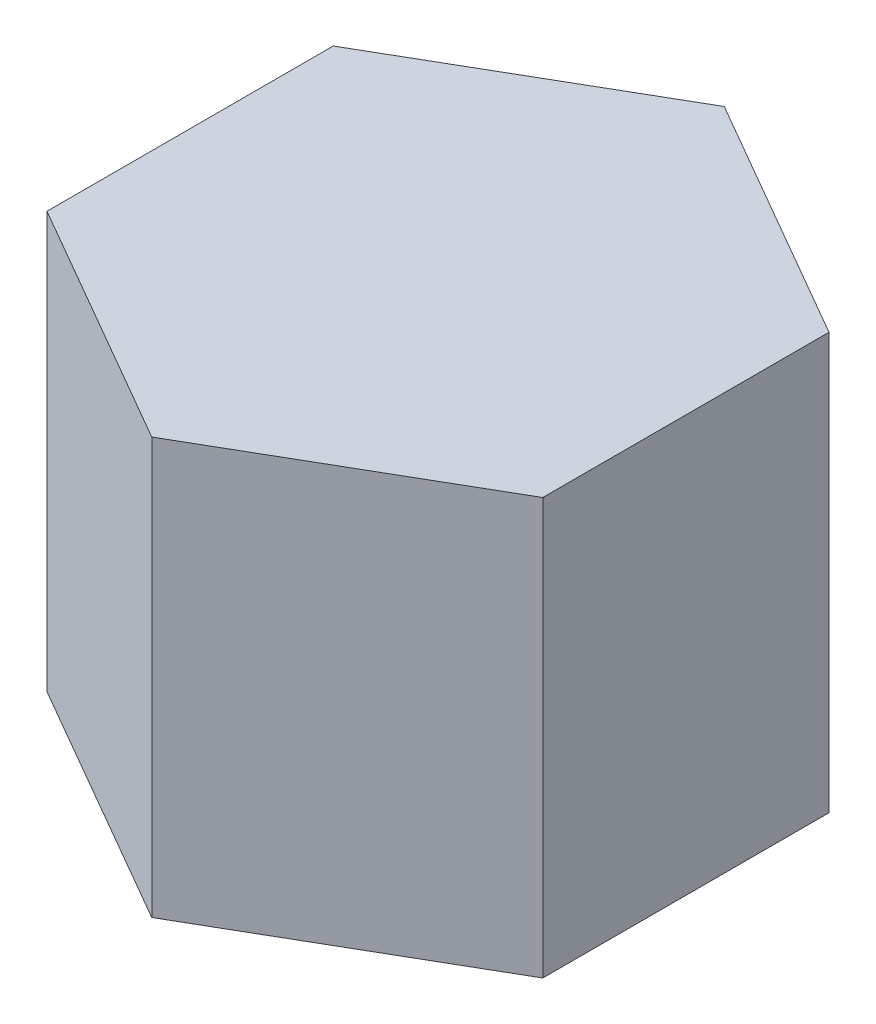
ISO-10303-21;
HEADER;
FILE_DESCRIPTION(('STEP AP214'),'2;1');
FILE_NAME('part.step','',(''),(''),'','','');
FILE_SCHEMA(('AUTOMOTIVE_DESIGN { 1 0 10303 214 1 1 1 1 }'));
ENDSEC;
DATA;
#1=APPLICATION_CONTEXT('core data for automotive mechanical design processes');
#2=APPLICATION_PROTOCOL_DEFINITION('international standard','automotive_design',2000,#1);
#3=PRODUCT_CONTEXT('',#1,'mechanical');
#4=PRODUCT('Part','Part','',(#3));
#5=PRODUCT_RELATED_PRODUCT_CATEGORY('part','',(#4));
#6=PRODUCT_DEFINITION_FORMATION('','',#4);
#7=PRODUCT_DEFINITION_CONTEXT('part definition',#1,'design');
#8=PRODUCT_DEFINITION('design','',#6,#7);
#9=PRODUCT_DEFINITION_SHAPE('','',#8);
#10=(LENGTH_UNIT() NAMED_UNIT(*) SI_UNIT(.MILLI.,.METRE.));
#11=(NAMED_UNIT(*) PLANE_ANGLE_UNIT() SI_UNIT($,.RADIAN.));
#12=(NAMED_UNIT(*) SI_UNIT($,.STERADIAN.) SOLID_ANGLE_UNIT());
#13=UNCERTAINTY_MEASURE_WITH_UNIT(LENGTH_MEASURE(1.E-05),#10,'distance_accuracy_value','');
#14=(GEOMETRIC_REPRESENTATION_CONTEXT(3) GLOBAL_UNCERTAINTY_ASSIGNED_CONTEXT((#13)) GLOBAL_UNIT_ASSIGNED_CONTEXT((#10,
#11,#12)) REPRESENTATION_CONTEXT('',''));
#15=CARTESIAN_POINT('',(0.,0.,0.));
#16=DIRECTION('',(0.,0.,1.));
#17=DIRECTION('',(1.,0.,0.));
#18=AXIS2_PLACEMENT_3D('',#15,#16,#17);
#19=CARTESIAN_POINT('',(206.839551417381,-147.556598747966,294.280047431848));
#20=DIRECTION('',(-0.500000000000062,0.,-0.866025403784403));
#21=DIRECTION('',(-0.866025403784403,0.,0.500000000000062));
#22=AXIS2_PLACEMENT_3D('',#19,#20,#21);
#23=PLANE('',#22);
#24=CARTESIAN_POINT('',(207.142660308706,-147.047793579175,294.105047431848));
#25=DIRECTION('',(-0.866025403784403,0.,0.500000000000062));
#26=VECTOR('',#25,1.);
#27=LINE('',#24,#26);
#28=CARTESIAN_POINT('',(207.142660308706,-147.047793579175,294.105047431848));
#29=VERTEX_POINT('',#28);
#30=CARTESIAN_POINT('',(206.839551417382,-147.047793579175,294.280047431848));
#31=VERTEX_POINT('',#30);
#32=EDGE_CURVE('E170',#29,#31,#27,.T.);
#33=ORIENTED_EDGE('',*,*,#32,.T.);
#34=CARTESIAN_POINT('',(206.839551417382,-147.556598747966,294.280047431848));
#35=DIRECTION('',(0.,1.,0.));
#36=VECTOR('',#35,1.);
#37=LINE('',#34,#36);
#38=CARTESIAN_POINT('',(206.839551417382,-147.556598747966,294.280047431848));
#39=VERTEX_POINT('',#38);
#40=EDGE_CURVE('E35',#39,#31,#37,.T.);
#41=ORIENTED_EDGE('',*,*,#40,.F.);
#42=CARTESIAN_POINT('',(207.142660308706,-147.556598747966,294.105047431848));
#43=DIRECTION('',(-0.866025403784403,0.,0.500000000000062));
#44=VECTOR('',#43,1.);
#45=LINE('',#42,#44);
#46=CARTESIAN_POINT('',(207.142660308706,-147.556598747966,294.105047431848));
#47=VERTEX_POINT('',#46);
#48=EDGE_CURVE('E159',#47,#39,#45,.T.);
#49=ORIENTED_EDGE('',*,*,#48,.F.);
#50=CARTESIAN_POINT('',(207.142660308706,-147.556598747966,294.105047431848));
#51=DIRECTION('',(0.,1.,0.));
#52=VECTOR('',#51,1.);
#53=LINE('',#50,#52);
#54=EDGE_CURVE('E10',#47,#29,#53,.T.);
#55=ORIENTED_EDGE('',*,*,#54,.T.);
#56=EDGE_LOOP('',(#33,#41,#49,#55));
#57=FACE_BOUND('',#56,.T.);
#58=ADVANCED_FACE('F16',(#57),#23,.F.);
#59=CARTESIAN_POINT('',(207.142660308706,-147.556598747966,291.594471220494));
#60=DIRECTION('',(-1.,0.,0.));
#61=DIRECTION('',(0.,-1.,0.));
#62=AXIS2_PLACEMENT_3D('',#59,#60,#61);
#63=PLANE('',#62);
#64=CARTESIAN_POINT('',(207.142660308706,-147.047793579175,293.755047431848));
#65=DIRECTION('',(0.,0.,1.));
#66=VECTOR('',#65,1.);
#67=LINE('',#64,#66);
#68=CARTESIAN_POINT('',(207.142660308706,-147.047793579175,293.755047431848));
#69=VERTEX_POINT('',#68);
#70=EDGE_CURVE('E167',#69,#29,#67,.T.);
#71=ORIENTED_EDGE('',*,*,#70,.T.);
#72=ORIENTED_EDGE('',*,*,#54,.F.);
#73=CARTESIAN_POINT('',(207.142660308706,-147.556598747966,293.755047431848));
#74=DIRECTION('',(0.,0.,1.));
#75=VECTOR('',#74,1.);
#76=LINE('',#73,#75);
#77=CARTESIAN_POINT('',(207.142660308706,-147.556598747966,293.755047431848));
#78=VERTEX_POINT('',#77);
#79=EDGE_CURVE('E156',#78,#47,#76,.T.);
#80=ORIENTED_EDGE('',*,*,#79,.F.);
#81=CARTESIAN_POINT('',(207.142660308706,-147.556598747966,293.755047431848));
#82=DIRECTION('',(0.,1.,0.));
#83=VECTOR('',#82,1.);
#84=LINE('',#81,#83);
#85=EDGE_CURVE('E27',#78,#69,#84,.T.);
#86=ORIENTED_EDGE('',*,*,#85,.T.);
#87=EDGE_LOOP('',(#71,#72,#80,#86));
#88=FACE_BOUND('',#87,.T.);
#89=ADVANCED_FACE('F189',(#88),#63,.F.);
#90=CARTESIAN_POINT('',(207.142660308706,-147.556598747966,293.755047431848));
#91=DIRECTION('',(-0.499999999999978,0.,0.866025403784452));
#92=DIRECTION('',(0.866025403784452,0.,0.499999999999978));
#93=AXIS2_PLACEMENT_3D('',#90,#91,#92);
#94=PLANE('',#93);
#95=CARTESIAN_POINT('',(206.839551417382,-147.047793579175,293.580047431848));
#96=DIRECTION('',(0.866025403784452,0.,0.499999999999978));
#97=VECTOR('',#96,1.);
#98=LINE('',#95,#97);
#99=CARTESIAN_POINT('',(206.839551417382,-147.047793579175,293.580047431848));
#100=VERTEX_POINT('',#99);
#101=EDGE_CURVE('E163',#100,#69,#98,.T.);
#102=ORIENTED_EDGE('',*,*,#101,.T.);
#103=ORIENTED_EDGE('',*,*,#85,.F.);
#104=CARTESIAN_POINT('',(206.839551417382,-147.556598747966,293.580047431848));
#105=DIRECTION('',(0.866025403784452,0.,0.499999999999978));
#106=VECTOR('',#105,1.);
#107=LINE('',#104,#106);
#108=CARTESIAN_POINT('',(206.839551417382,-147.556598747966,293.580047431848));
#109=VERTEX_POINT('',#108);
#110=EDGE_CURVE('E106',#109,#78,#107,.T.);
#111=ORIENTED_EDGE('',*,*,#110,.F.);
#112=CARTESIAN_POINT('',(206.839551417382,-147.556598747966,293.580047431848));
#113=DIRECTION('',(0.,1.,0.));
#114=VECTOR('',#113,1.);
#115=LINE('',#112,#114);
#116=EDGE_CURVE('E94',#109,#100,#115,.T.);
#117=ORIENTED_EDGE('',*,*,#116,.T.);
#118=EDGE_LOOP('',(#102,#103,#111,#117));
#119=FACE_BOUND('',#118,.T.);
#120=ADVANCED_FACE('F198',(#119),#94,.F.);
#121=CARTESIAN_POINT('',(206.839551417382,-147.556598747966,293.580047431848));
#122=DIRECTION('',(0.499999999999978,0.,0.866025403784452));
#123=DIRECTION('',(0.866025403784452,0.,-0.499999999999978));
#124=AXIS2_PLACEMENT_3D('',#121,#122,#123);
#125=PLANE('',#124);
#126=CARTESIAN_POINT('',(206.536442526057,-147.047793579175,293.755047431848));
#127=DIRECTION('',(0.866025403784452,0.,-0.499999999999978));
#128=VECTOR('',#127,1.);
#129=LINE('',#126,#128);
#130=CARTESIAN_POINT('',(206.536442526057,-147.047793579175,293.755047431848));
#131=VERTEX_POINT('',#130);
#132=EDGE_CURVE('E162',#131,#100,#129,.T.);
#133=ORIENTED_EDGE('',*,*,#132,.T.);
#134=ORIENTED_EDGE('',*,*,#116,.F.);
#135=CARTESIAN_POINT('',(206.536442526057,-147.556598747966,293.755047431848));
#136=DIRECTION('',(0.866025403784452,0.,-0.499999999999978));
#137=VECTOR('',#136,1.);
#138=LINE('',#135,#137);
#139=CARTESIAN_POINT('',(206.536442526057,-147.556598747966,293.755047431848));
#140=VERTEX_POINT('',#139);
#141=EDGE_CURVE('E98',#140,#109,#138,.T.);
#142=ORIENTED_EDGE('',*,*,#141,.F.);
#143=CARTESIAN_POINT('',(206.536442526057,-147.556598747966,293.755047431848));
#144=DIRECTION('',(0.,1.,0.));
#145=VECTOR('',#144,1.);
#146=LINE('',#143,#145);
#147=EDGE_CURVE('E79',#140,#131,#146,.T.);
#148=ORIENTED_EDGE('',*,*,#147,.T.);
#149=EDGE_LOOP('',(#133,#134,#142,#148));
#150=FACE_BOUND('',#149,.T.);
#151=ADVANCED_FACE('F100',(#150),#125,.F.);
#152=CARTESIAN_POINT('',(206.536442526057,-147.556598747966,291.594471220494));
#153=DIRECTION('',(1.,0.,0.));
#154=DIRECTION('',(0.,1.,0.));
#155=AXIS2_PLACEMENT_3D('',#152,#153,#154);
#156=PLANE('',#155);
#157=CARTESIAN_POINT('',(206.536442526057,-147.047793579175,294.105047431848));
#158=DIRECTION('',(0.,0.,-1.));
#159=VECTOR('',#158,1.);
#160=LINE('',#157,#159);
#161=CARTESIAN_POINT('',(206.536442526057,-147.047793579175,294.105047431848));
#162=VERTEX_POINT('',#161);
#163=EDGE_CURVE('E88',#162,#131,#160,.T.);
#164=ORIENTED_EDGE('',*,*,#163,.T.);
#165=ORIENTED_EDGE('',*,*,#147,.F.);
#166=CARTESIAN_POINT('',(206.536442526057,-147.556598747966,294.105047431848));
#167=DIRECTION('',(0.,0.,-1.));
#168=VECTOR('',#167,1.);
#169=LINE('',#166,#168);
#170=CARTESIAN_POINT('',(206.536442526057,-147.556598747966,294.105047431848));
#171=VERTEX_POINT('',#170);
#172=EDGE_CURVE('E84',#171,#140,#169,.T.);
#173=ORIENTED_EDGE('',*,*,#172,.F.);
#174=CARTESIAN_POINT('',(206.536442526057,-147.556598747966,294.105047431848));
#175=DIRECTION('',(0.,1.,0.));
#176=VECTOR('',#175,1.);
#177=LINE('',#174,#176);
#178=EDGE_CURVE('E58',#171,#162,#177,.T.);
#179=ORIENTED_EDGE('',*,*,#178,.T.);
#180=EDGE_LOOP('',(#164,#165,#173,#179));
#181=FACE_BOUND('',#180,.T.);
#182=ADVANCED_FACE('F82',(#181),#156,.F.);
#183=CARTESIAN_POINT('',(206.536442526057,-147.556598747966,294.105047431848));
#184=DIRECTION('',(0.500000000000062,0.,-0.866025403784403));
#185=DIRECTION('',(-0.866025403784403,0.,-0.500000000000062));
#186=AXIS2_PLACEMENT_3D('',#183,#184,#185);
#187=PLANE('',#186);
#188=CARTESIAN_POINT('',(206.839551417382,-147.047793579175,294.280047431848));
#189=DIRECTION('',(-0.866025403784403,0.,-0.500000000000062));
#190=VECTOR('',#189,1.);
#191=LINE('',#188,#190);
#192=EDGE_CURVE('E160',#31,#162,#191,.T.);
#193=ORIENTED_EDGE('',*,*,#192,.T.);
#194=ORIENTED_EDGE('',*,*,#178,.F.);
#195=CARTESIAN_POINT('',(206.839551417382,-147.556598747966,294.280047431848));
#196=DIRECTION('',(-0.866025403784403,0.,-0.500000000000062));
#197=VECTOR('',#196,1.);
#198=LINE('',#195,#197);
#199=EDGE_CURVE('E112',#39,#171,#198,.T.);
#200=ORIENTED_EDGE('',*,*,#199,.F.);
#201=ORIENTED_EDGE('',*,*,#40,.T.);
#202=EDGE_LOOP('',(#193,#194,#200,#201));
#203=FACE_BOUND('',#202,.T.);
#204=ADVANCED_FACE('F131',(#203),#187,.F.);
#205=CARTESIAN_POINT('',(206.491105863044,-147.556598747966,291.594471220494));
#206=DIRECTION('',(0.,1.,0.));
#207=DIRECTION('',(-1.,0.,0.));
#208=AXIS2_PLACEMENT_3D('',#205,#206,#207);
#209=PLANE('',#208);
#210=ORIENTED_EDGE('',*,*,#48,.T.);
#211=ORIENTED_EDGE('',*,*,#199,.T.);
#212=ORIENTED_EDGE('',*,*,#172,.T.);
#213=ORIENTED_EDGE('',*,*,#141,.T.);
#214=ORIENTED_EDGE('',*,*,#110,.T.);
#215=ORIENTED_EDGE('',*,*,#79,.T.);
#216=EDGE_LOOP('',(#210,#211,#212,#213,#214,#215));
#217=FACE_BOUND('',#216,.T.);
#218=ADVANCED_FACE('F111',(#217),#209,.F.);
#219=CARTESIAN_POINT('',(206.491105863044,-147.047793579175,291.594471220494));
#220=DIRECTION('',(0.,1.,0.));
#221=DIRECTION('',(-1.,0.,0.));
#222=AXIS2_PLACEMENT_3D('',#219,#220,#221);
#223=PLANE('',#222);
#224=ORIENTED_EDGE('',*,*,#32,.F.);
#225=ORIENTED_EDGE('',*,*,#70,.F.);
#226=ORIENTED_EDGE('',*,*,#101,.F.);
#227=ORIENTED_EDGE('',*,*,#132,.F.);
#228=ORIENTED_EDGE('',*,*,#163,.F.);
#229=ORIENTED_EDGE('',*,*,#192,.F.);
#230=EDGE_LOOP('',(#224,#225,#226,#227,#228,#229));
#231=FACE_BOUND('',#230,.T.);
#232=ADVANCED_FACE('F130',(#231),#223,.T.);
#233=CLOSED_SHELL('',(#58,#89,#120,#151,#182,#204,#218,#232));
#234=MANIFOLD_SOLID_BREP('B1',#233);
#235=ADVANCED_BREP_SHAPE_REPRESENTATION('',(#18,#234),#14);
#236=SHAPE_DEFINITION_REPRESENTATION(#9,#235);
ENDSEC;
END-ISO-10303-21;
